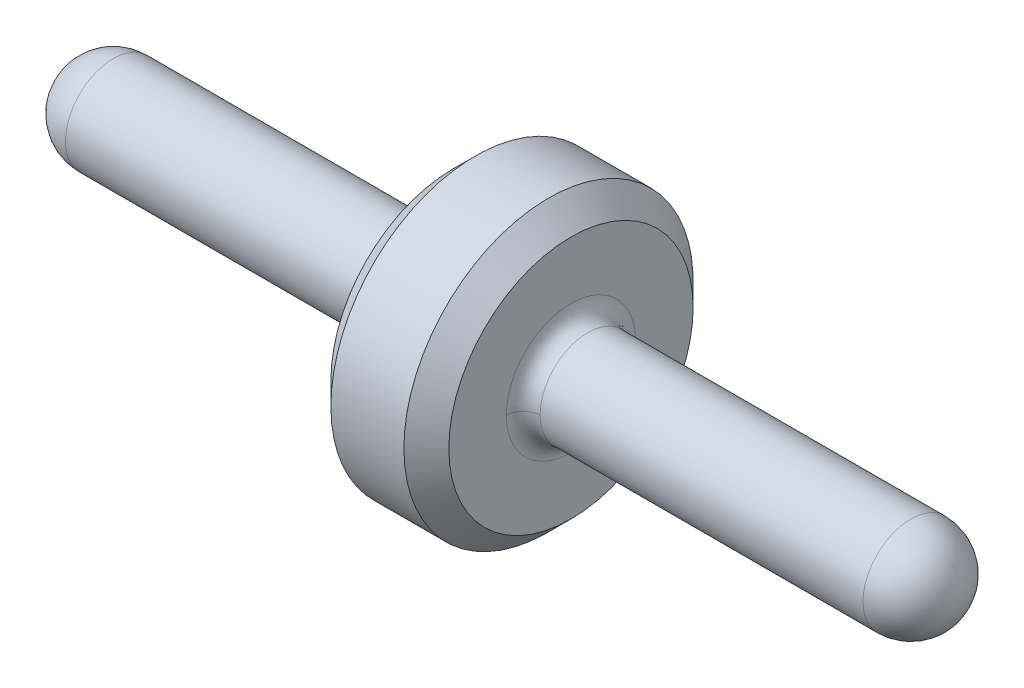
ISO-10303-21;
HEADER;
FILE_DESCRIPTION(('STEP AP214'),'2;1');
FILE_NAME('part.step','',(''),(''),'','','');
FILE_SCHEMA(('AUTOMOTIVE_DESIGN { 1 0 10303 214 1 1 1 1 }'));
ENDSEC;
DATA;
#1=APPLICATION_CONTEXT('core data for automotive mechanical design processes');
#2=APPLICATION_PROTOCOL_DEFINITION('international standard','automotive_design',2000,#1);
#3=PRODUCT_CONTEXT('',#1,'mechanical');
#4=PRODUCT('Part','Part','',(#3));
#5=PRODUCT_RELATED_PRODUCT_CATEGORY('part','',(#4));
#6=PRODUCT_DEFINITION_FORMATION('','',#4);
#7=PRODUCT_DEFINITION_CONTEXT('part definition',#1,'design');
#8=PRODUCT_DEFINITION('design','',#6,#7);
#9=PRODUCT_DEFINITION_SHAPE('','',#8);
#10=(LENGTH_UNIT() NAMED_UNIT(*) SI_UNIT(.MILLI.,.METRE.));
#11=(NAMED_UNIT(*) PLANE_ANGLE_UNIT() SI_UNIT($,.RADIAN.));
#12=(NAMED_UNIT(*) SI_UNIT($,.STERADIAN.) SOLID_ANGLE_UNIT());
#13=UNCERTAINTY_MEASURE_WITH_UNIT(LENGTH_MEASURE(1.E-05),#10,'distance_accuracy_value','');
#14=(GEOMETRIC_REPRESENTATION_CONTEXT(3) GLOBAL_UNCERTAINTY_ASSIGNED_CONTEXT((#13)) GLOBAL_UNIT_ASSIGNED_CONTEXT((#10,
#11,#12)) REPRESENTATION_CONTEXT('',''));
#15=CARTESIAN_POINT('',(0.,0.,0.));
#16=DIRECTION('',(0.,0.,1.));
#17=DIRECTION('',(1.,0.,0.));
#18=AXIS2_PLACEMENT_3D('',#15,#16,#17);
#19=CARTESIAN_POINT('',(3.8227,0.,0.));
#20=DIRECTION('',(-1.,0.,0.));
#21=DIRECTION('',(0.,-1.,0.));
#22=AXIS2_PLACEMENT_3D('',#19,#20,#21);
#23=SPHERICAL_SURFACE('',#22,0.2159);
#24=CARTESIAN_POINT('',(4.0386,2.159E-09,0.));
#25=VERTEX_POINT('',#24);
#26=VERTEX_LOOP('',#25);
#27=FACE_BOUND('',#26,.T.);
#28=CARTESIAN_POINT('',(3.8227,0.,0.));
#29=DIRECTION('',(-1.,0.,0.));
#30=DIRECTION('',(0.,0.,1.));
#31=AXIS2_PLACEMENT_3D('',#28,#29,#30);
#32=CIRCLE('',#31,0.2159);
#33=CARTESIAN_POINT('',(3.8227,0.,0.2159));
#34=VERTEX_POINT('',#33);
#35=EDGE_CURVE('E74',#34,#34,#32,.F.);
#36=ORIENTED_EDGE('',*,*,#35,.T.);
#37=EDGE_LOOP('',(#36));
#38=FACE_BOUND('',#37,.T.);
#39=ADVANCED_FACE('F17',(#27,#38),#23,.T.);
#40=CARTESIAN_POINT('',(3.8227,0.,0.));
#41=DIRECTION('',(-1.,0.,0.));
#42=DIRECTION('',(0.,0.,1.));
#43=AXIS2_PLACEMENT_3D('',#40,#41,#42);
#44=CYLINDRICAL_SURFACE('',#43,0.2159);
#45=CARTESIAN_POINT('',(2.3622,0.,0.));
#46=DIRECTION('',(-1.,0.,0.));
#47=DIRECTION('',(0.,0.,1.));
#48=AXIS2_PLACEMENT_3D('',#45,#46,#47);
#49=CIRCLE('',#48,0.2159);
#50=CARTESIAN_POINT('',(2.36219999777847,-4.428183021646E-11,-0.215900005892549));
#51=VERTEX_POINT('',#50);
#52=CARTESIAN_POINT('',(2.3622,-1.93864443777635E-11,0.2159));
#53=VERTEX_POINT('',#52);
#54=EDGE_CURVE('E22',#51,#53,#49,.F.);
#55=ORIENTED_EDGE('',*,*,#54,.T.);
#56=CARTESIAN_POINT('',(2.3622,0.,0.));
#57=DIRECTION('',(-1.,0.,0.));
#58=DIRECTION('',(0.,0.,1.));
#59=AXIS2_PLACEMENT_3D('',#56,#57,#58);
#60=CIRCLE('',#59,0.2159);
#61=EDGE_CURVE('E64',#51,#53,#60,.T.);
#62=ORIENTED_EDGE('',*,*,#61,.F.);
#63=EDGE_LOOP('',(#55,#62));
#64=FACE_BOUND('',#63,.T.);
#65=ORIENTED_EDGE('',*,*,#35,.F.);
#66=EDGE_LOOP('',(#65));
#67=FACE_BOUND('',#66,.T.);
#68=ADVANCED_FACE('F76',(#64,#67),#44,.T.);
#69=CARTESIAN_POINT('',(2.3698073,0.,-0.2162806952));
#70=CARTESIAN_POINT('',(2.3698073,-0.432561365,-0.2162806952));
#71=CARTESIAN_POINT('',(2.3698073,-0.432561365,0.2162806952));
#72=CARTESIAN_POINT('',(2.3698073,0.,0.2162806952));
#73=CARTESIAN_POINT('',(2.3179999106,0.,-0.2110826106));
#74=CARTESIAN_POINT('',(2.3179999106,-0.4221651958,-0.2110826106));
#75=CARTESIAN_POINT('',(2.3179999106,-0.4221651958,0.2110826106));
#76=CARTESIAN_POINT('',(2.3179999106,0.,0.2110826106));
#77=CARTESIAN_POINT('',(2.2811826106,0.,-0.2478999106));
#78=CARTESIAN_POINT('',(2.2811826106,-0.4957997958,-0.2478999106));
#79=CARTESIAN_POINT('',(2.2811826106,-0.4957997958,0.2478999106));
#80=CARTESIAN_POINT('',(2.2811826106,0.,0.2478999106));
#81=CARTESIAN_POINT('',(2.2863806952,0.,-0.2997073));
#82=CARTESIAN_POINT('',(2.2863806952,-0.5994146,-0.2997073));
#83=CARTESIAN_POINT('',(2.2863806952,-0.5994146,0.2997073));
#84=CARTESIAN_POINT('',(2.2863806952,0.,0.2997073));
#85=(BOUNDED_SURFACE() B_SPLINE_SURFACE(3,3,((#69,#70,#71,#72),(#73,#74,#75,#76),(#77,#78,#79,
#80),(#81,#82,#83,#84)),.UNSPECIFIED.,.F.,.F.,.F.) B_SPLINE_SURFACE_WITH_KNOTS((4,4),(4,4),(0.,
1.),(0.,1.),.UNSPECIFIED.) GEOMETRIC_REPRESENTATION_ITEM() RATIONAL_B_SPLINE_SURFACE(((1.,
0.333333333333333,0.333333333333333,1.),(0.755320871117973,0.251773623705991,0.251773623705991,
0.755320871117973),(0.755320871117973,0.251773623705991,0.251773623705991,0.755320871117973),
(1.,0.333333333333333,0.333333333333333,1.))) REPRESENTATION_ITEM('') SURFACE());
#86=CARTESIAN_POINT('',(2.3698073,0.,-0.2162806952));
#87=CARTESIAN_POINT('',(2.3179999106,0.,-0.2110826106));
#88=CARTESIAN_POINT('',(2.2811826106,0.,-0.2478999106));
#89=CARTESIAN_POINT('',(2.2863806952,0.,-0.2997073));
#90=(BOUNDED_CURVE() B_SPLINE_CURVE(3,(#86,#87,#88,#89),.UNSPECIFIED.,.F.,
.F.) B_SPLINE_CURVE_WITH_KNOTS((4,4),(0.,1.),
.UNSPECIFIED.) CURVE() GEOMETRIC_REPRESENTATION_ITEM() RATIONAL_B_SPLINE_CURVE((1.,
0.755320871117973,0.755320871117973,1.)) REPRESENTATION_ITEM(''));
#91=CARTESIAN_POINT('',(2.28600000707106,0.,-0.29209999924224));
#92=VERTEX_POINT('',#91);
#93=EDGE_CURVE('E72',#92,#51,#90,.F.);
#94=CARTESIAN_POINT('',(2.3698073,0.,0.2162806952));
#95=CARTESIAN_POINT('',(2.3179999106,0.,0.2110826106));
#96=CARTESIAN_POINT('',(2.2811826106,0.,0.2478999106));
#97=CARTESIAN_POINT('',(2.2863806952,0.,0.2997073));
#98=(BOUNDED_CURVE() B_SPLINE_CURVE(3,(#94,#95,#96,#97),.UNSPECIFIED.,.F.,
.F.) B_SPLINE_CURVE_WITH_KNOTS((4,4),(0.,1.),
.UNSPECIFIED.) CURVE() GEOMETRIC_REPRESENTATION_ITEM() RATIONAL_B_SPLINE_CURVE((1.,
0.755320871117973,0.755320871117973,1.)) REPRESENTATION_ITEM(''));
#99=CARTESIAN_POINT('',(2.28600000707106,0.,0.29209999924224));
#100=VERTEX_POINT('',#99);
#101=EDGE_CURVE('E69',#53,#100,#98,.T.);
#102=CARTESIAN_POINT('',(2.2860000117851,0.,0.29210000016356));
#103=CARTESIAN_POINT('',(2.2860000117851,-0.584199996761219,0.29210000016356));
#104=CARTESIAN_POINT('',(2.2860000117851,-0.584199996761219,-0.29210000016356));
#105=CARTESIAN_POINT('',(2.2860000117851,0.,-0.29210000016356));
#106=(BOUNDED_CURVE() B_SPLINE_CURVE(3,(#102,#103,#104,#105),.UNSPECIFIED.,.F.,
.F.) B_SPLINE_CURVE_WITH_KNOTS((4,4),(0.,1.),
.UNSPECIFIED.) CURVE() GEOMETRIC_REPRESENTATION_ITEM() RATIONAL_B_SPLINE_CURVE((0.956578326119741,
0.318859442039913,0.318859442039913,0.956578326119741)) REPRESENTATION_ITEM(''));
#107=EDGE_CURVE('E202',#100,#92,#106,.T.);
#108=ORIENTED_EDGE('',*,*,#93,.T.);
#109=ORIENTED_EDGE('',*,*,#61,.T.);
#110=ORIENTED_EDGE('',*,*,#101,.T.);
#111=ORIENTED_EDGE('',*,*,#107,.T.);
#112=EDGE_LOOP('',(#108,#109,#110,#111));
#113=FACE_BOUND('',#112,.T.);
#114=ADVANCED_FACE('F67',(#113),#85,.F.);
#115=CARTESIAN_POINT('',(2.3698073,0.,0.2162806952));
#116=CARTESIAN_POINT('',(2.3698073,0.432561365,0.2162806952));
#117=CARTESIAN_POINT('',(2.3698073,0.432561365,-0.2162806952));
#118=CARTESIAN_POINT('',(2.3698073,0.,-0.2162806952));
#119=CARTESIAN_POINT('',(2.3179999106,0.,0.2110826106));
#120=CARTESIAN_POINT('',(2.3179999106,0.4221651958,0.2110826106));
#121=CARTESIAN_POINT('',(2.3179999106,0.4221651958,-0.2110826106));
#122=CARTESIAN_POINT('',(2.3179999106,0.,-0.2110826106));
#123=CARTESIAN_POINT('',(2.2811826106,0.,0.2478999106));
#124=CARTESIAN_POINT('',(2.2811826106,0.4957997958,0.2478999106));
#125=CARTESIAN_POINT('',(2.2811826106,0.4957997958,-0.2478999106));
#126=CARTESIAN_POINT('',(2.2811826106,0.,-0.2478999106));
#127=CARTESIAN_POINT('',(2.2863806952,0.,0.2997073));
#128=CARTESIAN_POINT('',(2.2863806952,0.5994146,0.2997073));
#129=CARTESIAN_POINT('',(2.2863806952,0.5994146,-0.2997073));
#130=CARTESIAN_POINT('',(2.2863806952,0.,-0.2997073));
#131=(BOUNDED_SURFACE() B_SPLINE_SURFACE(3,3,((#115,#116,#117,#118),(#119,#120,#121,#122),(#123,
#124,#125,#126),(#127,#128,#129,#130)),.UNSPECIFIED.,.F.,.F.,
.F.) B_SPLINE_SURFACE_WITH_KNOTS((4,4),(4,4),(0.,1.),(0.,1.),
.UNSPECIFIED.) GEOMETRIC_REPRESENTATION_ITEM() RATIONAL_B_SPLINE_SURFACE(((1.,0.333333333333333,
0.333333333333333,1.),(0.755320871117973,0.251773623705991,0.251773623705991,0.755320871117973),
(0.755320871117973,0.251773623705991,0.251773623705991,0.755320871117973),(1.,0.333333333333333,
0.333333333333333,1.))) REPRESENTATION_ITEM('') SURFACE());
#132=CARTESIAN_POINT('',(2.2860000117851,0.,-0.292100000163559));
#133=CARTESIAN_POINT('',(2.2860000117851,0.584199996761219,-0.29210000016356));
#134=CARTESIAN_POINT('',(2.2860000117851,0.584199996761219,0.29210000016356));
#135=CARTESIAN_POINT('',(2.2860000117851,0.,0.292100000163559));
#136=(BOUNDED_CURVE() B_SPLINE_CURVE(3,(#132,#133,#134,#135),.UNSPECIFIED.,.F.,
.F.) B_SPLINE_CURVE_WITH_KNOTS((4,4),(0.,1.),
.UNSPECIFIED.) CURVE() GEOMETRIC_REPRESENTATION_ITEM() RATIONAL_B_SPLINE_CURVE((0.95657832611974,
0.318859442039913,0.318859442039913,0.95657832611974)) REPRESENTATION_ITEM(''));
#137=EDGE_CURVE('E81',#92,#100,#136,.T.);
#138=ORIENTED_EDGE('',*,*,#137,.T.);
#139=ORIENTED_EDGE('',*,*,#101,.F.);
#140=ORIENTED_EDGE('',*,*,#54,.F.);
#141=ORIENTED_EDGE('',*,*,#93,.F.);
#142=EDGE_LOOP('',(#138,#139,#140,#141));
#143=FACE_BOUND('',#142,.T.);
#144=ADVANCED_FACE('F79',(#143),#131,.F.);
#145=CARTESIAN_POINT('',(0.2159,0.,0.));
#146=DIRECTION('',(-1.,0.,0.));
#147=DIRECTION('',(0.,-1.,0.));
#148=AXIS2_PLACEMENT_3D('',#145,#146,#147);
#149=SPHERICAL_SURFACE('',#148,0.2159);
#150=CARTESIAN_POINT('',(0.,2.07043632644582E-09,0.));
#151=VERTEX_POINT('',#150);
#152=VERTEX_LOOP('',#151);
#153=FACE_BOUND('',#152,.T.);
#154=CARTESIAN_POINT('',(0.2159,0.,0.));
#155=DIRECTION('',(-1.,0.,0.));
#156=DIRECTION('',(0.,0.,1.));
#157=AXIS2_PLACEMENT_3D('',#154,#155,#156);
#158=CIRCLE('',#157,0.2159);
#159=CARTESIAN_POINT('',(0.2159,0.,0.2159));
#160=VERTEX_POINT('',#159);
#161=EDGE_CURVE('E194',#160,#160,#158,.T.);
#162=ORIENTED_EDGE('',*,*,#161,.T.);
#163=EDGE_LOOP('',(#162));
#164=FACE_BOUND('',#163,.T.);
#165=ADVANCED_FACE('F115',(#153,#164),#149,.T.);
#166=CARTESIAN_POINT('',(2.286,-0.5590794,-0.5590794));
#167=DIRECTION('',(-1.,0.,0.));
#168=DIRECTION('',(0.,0.,1.));
#169=AXIS2_PLACEMENT_3D('',#166,#167,#168);
#170=PLANE('',#169);
#171=ORIENTED_EDGE('',*,*,#107,.F.);
#172=ORIENTED_EDGE('',*,*,#137,.F.);
#173=EDGE_LOOP('',(#171,#172));
#174=FACE_BOUND('',#173,.T.);
#175=CARTESIAN_POINT('',(2.28600000000001,0.,0.));
#176=DIRECTION('',(-1.,0.,0.));
#177=DIRECTION('',(0.,0.,1.));
#178=AXIS2_PLACEMENT_3D('',#175,#176,#177);
#179=CIRCLE('',#178,0.552449999999991);
#180=CARTESIAN_POINT('',(2.28600000000001,0.,0.552449999999991));
#181=VERTEX_POINT('',#180);
#182=EDGE_CURVE('E192',#181,#181,#179,.F.);
#183=ORIENTED_EDGE('',*,*,#182,.T.);
#184=EDGE_LOOP('',(#183));
#185=FACE_BOUND('',#184,.T.);
#186=ADVANCED_FACE('F146',(#174,#185),#170,.F.);
#187=CARTESIAN_POINT('',(1.6764,0.,0.));
#188=DIRECTION('',(-1.,0.,0.));
#189=DIRECTION('',(0.,-1.,0.));
#190=AXIS2_PLACEMENT_3D('',#187,#188,#189);
#191=CYLINDRICAL_SURFACE('',#190,0.2159);
#192=ORIENTED_EDGE('',*,*,#161,.F.);
#193=EDGE_LOOP('',(#192));
#194=FACE_BOUND('',#193,.T.);
#195=CARTESIAN_POINT('',(1.6764,0.,0.));
#196=DIRECTION('',(-1.,0.,0.));
#197=DIRECTION('',(0.,-1.,0.));
#198=AXIS2_PLACEMENT_3D('',#195,#196,#197);
#199=CIRCLE('',#198,0.2159);
#200=CARTESIAN_POINT('',(1.67640000222154,-1.93864443777635E-11,0.215900005892549));
#201=VERTEX_POINT('',#200);
#202=CARTESIAN_POINT('',(1.6764,-4.428183021646E-11,-0.2159));
#203=VERTEX_POINT('',#202);
#204=EDGE_CURVE('E188',#201,#203,#199,.T.);
#205=ORIENTED_EDGE('',*,*,#204,.T.);
#206=CARTESIAN_POINT('',(1.6764,0.,0.));
#207=DIRECTION('',(-1.,0.,0.));
#208=DIRECTION('',(0.,0.,1.));
#209=AXIS2_PLACEMENT_3D('',#206,#207,#208);
#210=CIRCLE('',#209,0.2159);
#211=EDGE_CURVE('E85',#201,#203,#210,.F.);
#212=ORIENTED_EDGE('',*,*,#211,.F.);
#213=EDGE_LOOP('',(#205,#212));
#214=FACE_BOUND('',#213,.T.);
#215=ADVANCED_FACE('F149',(#194,#214),#191,.T.);
#216=CARTESIAN_POINT('',(2.286,0.,0.));
#217=DIRECTION('',(-1.,0.,0.));
#218=DIRECTION('',(0.,0.,1.));
#219=AXIS2_PLACEMENT_3D('',#216,#217,#218);
#220=CONICAL_SURFACE('',#219,0.55245,0.785398163397449);
#221=ORIENTED_EDGE('',*,*,#182,.F.);
#222=EDGE_LOOP('',(#221));
#223=FACE_BOUND('',#222,.T.);
#224=CARTESIAN_POINT('',(2.1844,0.,0.));
#225=DIRECTION('',(-1.,0.,0.));
#226=DIRECTION('',(0.,0.,1.));
#227=AXIS2_PLACEMENT_3D('',#224,#225,#226);
#228=CIRCLE('',#227,0.65405);
#229=CARTESIAN_POINT('',(2.1844,0.,0.65405));
#230=VERTEX_POINT('',#229);
#231=EDGE_CURVE('E207',#230,#230,#228,.F.);
#232=ORIENTED_EDGE('',*,*,#231,.T.);
#233=EDGE_LOOP('',(#232));
#234=FACE_BOUND('',#233,.T.);
#235=ADVANCED_FACE('F256',(#223,#234),#220,.T.);
#236=CARTESIAN_POINT('',(1.7522193048,0.,-0.2997073));
#237=CARTESIAN_POINT('',(1.7522193048,-0.5994146,-0.2997073));
#238=CARTESIAN_POINT('',(1.7522193048,-0.5994146,0.2997073));
#239=CARTESIAN_POINT('',(1.7522193048,0.,0.2997073));
#240=CARTESIAN_POINT('',(1.7574173894,0.,-0.2478999106));
#241=CARTESIAN_POINT('',(1.7574173894,-0.4957997958,-0.2478999106));
#242=CARTESIAN_POINT('',(1.7574173894,-0.4957997958,0.2478999106));
#243=CARTESIAN_POINT('',(1.7574173894,0.,0.2478999106));
#244=CARTESIAN_POINT('',(1.7206000894,0.,-0.2110826106));
#245=CARTESIAN_POINT('',(1.7206000894,-0.4221651958,-0.2110826106));
#246=CARTESIAN_POINT('',(1.7206000894,-0.4221651958,0.2110826106));
#247=CARTESIAN_POINT('',(1.7206000894,0.,0.2110826106));
#248=CARTESIAN_POINT('',(1.6687927,0.,-0.2162806952));
#249=CARTESIAN_POINT('',(1.6687927,-0.432561365,-0.2162806952));
#250=CARTESIAN_POINT('',(1.6687927,-0.432561365,0.2162806952));
#251=CARTESIAN_POINT('',(1.6687927,0.,0.2162806952));
#252=(BOUNDED_SURFACE() B_SPLINE_SURFACE(3,3,((#236,#237,#238,#239),(#240,#241,#242,#243),(#244,
#245,#246,#247),(#248,#249,#250,#251)),.UNSPECIFIED.,.F.,.F.,
.F.) B_SPLINE_SURFACE_WITH_KNOTS((4,4),(4,4),(0.,1.),(0.,1.),
.UNSPECIFIED.) GEOMETRIC_REPRESENTATION_ITEM() RATIONAL_B_SPLINE_SURFACE(((1.,0.333333333333333,
0.333333333333333,1.),(0.755320871117972,0.251773623705991,0.251773623705991,0.755320871117972),
(0.755320871117972,0.251773623705991,0.251773623705991,0.755320871117972),(1.,0.333333333333333,
0.333333333333333,1.))) REPRESENTATION_ITEM('') SURFACE());
#253=CARTESIAN_POINT('',(1.7522193048,0.,-0.2997073));
#254=CARTESIAN_POINT('',(1.7574173894,0.,-0.2478999106));
#255=CARTESIAN_POINT('',(1.7206000894,0.,-0.2110826106));
#256=CARTESIAN_POINT('',(1.6687927,0.,-0.2162806952));
#257=(BOUNDED_CURVE() B_SPLINE_CURVE(3,(#253,#254,#255,#256),.UNSPECIFIED.,.F.,
.F.) B_SPLINE_CURVE_WITH_KNOTS((4,4),(0.,1.),
.UNSPECIFIED.) CURVE() GEOMETRIC_REPRESENTATION_ITEM() RATIONAL_B_SPLINE_CURVE((1.,
0.755320871117972,0.755320871117972,1.)) REPRESENTATION_ITEM(''));
#258=CARTESIAN_POINT('',(1.75259999292894,0.,-0.29209999924224));
#259=VERTEX_POINT('',#258);
#260=EDGE_CURVE('E190',#203,#259,#257,.F.);
#261=CARTESIAN_POINT('',(1.7525999882149,0.,-0.29210000016356));
#262=CARTESIAN_POINT('',(1.7525999882149,-0.584199996761219,-0.29210000016356));
#263=CARTESIAN_POINT('',(1.7525999882149,-0.584199996761219,0.29210000016356));
#264=CARTESIAN_POINT('',(1.7525999882149,0.,0.29210000016356));
#265=(BOUNDED_CURVE() B_SPLINE_CURVE(3,(#261,#262,#263,#264),.UNSPECIFIED.,.F.,
.F.) B_SPLINE_CURVE_WITH_KNOTS((4,4),(0.,1.),
.UNSPECIFIED.) CURVE() GEOMETRIC_REPRESENTATION_ITEM() RATIONAL_B_SPLINE_CURVE((0.956578326119741,
0.318859442039913,0.318859442039913,0.956578326119741)) REPRESENTATION_ITEM(''));
#266=CARTESIAN_POINT('',(1.75259999292894,0.,0.29209999924224));
#267=VERTEX_POINT('',#266);
#268=EDGE_CURVE('E37',#259,#267,#265,.T.);
#269=CARTESIAN_POINT('',(1.7522193048,0.,0.2997073));
#270=CARTESIAN_POINT('',(1.7574173894,0.,0.2478999106));
#271=CARTESIAN_POINT('',(1.7206000894,0.,0.2110826106));
#272=CARTESIAN_POINT('',(1.6687927,0.,0.2162806952));
#273=(BOUNDED_CURVE() B_SPLINE_CURVE(3,(#269,#270,#271,#272),.UNSPECIFIED.,.F.,
.F.) B_SPLINE_CURVE_WITH_KNOTS((4,4),(0.,1.),
.UNSPECIFIED.) CURVE() GEOMETRIC_REPRESENTATION_ITEM() RATIONAL_B_SPLINE_CURVE((1.,
0.755320871117972,0.755320871117972,1.)) REPRESENTATION_ITEM(''));
#274=EDGE_CURVE('E191',#267,#201,#273,.T.);
#275=ORIENTED_EDGE('',*,*,#260,.T.);
#276=ORIENTED_EDGE('',*,*,#268,.T.);
#277=ORIENTED_EDGE('',*,*,#274,.T.);
#278=ORIENTED_EDGE('',*,*,#211,.T.);
#279=EDGE_LOOP('',(#275,#276,#277,#278));
#280=FACE_BOUND('',#279,.T.);
#281=ADVANCED_FACE('F244',(#280),#252,.F.);
#282=CARTESIAN_POINT('',(1.7522193048,0.,0.2997073));
#283=CARTESIAN_POINT('',(1.7522193048,0.5994146,0.2997073));
#284=CARTESIAN_POINT('',(1.7522193048,0.5994146,-0.2997073));
#285=CARTESIAN_POINT('',(1.7522193048,0.,-0.2997073));
#286=CARTESIAN_POINT('',(1.7574173894,0.,0.2478999106));
#287=CARTESIAN_POINT('',(1.7574173894,0.4957997958,0.2478999106));
#288=CARTESIAN_POINT('',(1.7574173894,0.4957997958,-0.2478999106));
#289=CARTESIAN_POINT('',(1.7574173894,0.,-0.2478999106));
#290=CARTESIAN_POINT('',(1.7206000894,0.,0.2110826106));
#291=CARTESIAN_POINT('',(1.7206000894,0.4221651958,0.2110826106));
#292=CARTESIAN_POINT('',(1.7206000894,0.4221651958,-0.2110826106));
#293=CARTESIAN_POINT('',(1.7206000894,0.,-0.2110826106));
#294=CARTESIAN_POINT('',(1.6687927,0.,0.2162806952));
#295=CARTESIAN_POINT('',(1.6687927,0.432561365,0.2162806952));
#296=CARTESIAN_POINT('',(1.6687927,0.432561365,-0.2162806952));
#297=CARTESIAN_POINT('',(1.6687927,0.,-0.2162806952));
#298=(BOUNDED_SURFACE() B_SPLINE_SURFACE(3,3,((#282,#283,#284,#285),(#286,#287,#288,#289),(#290,
#291,#292,#293),(#294,#295,#296,#297)),.UNSPECIFIED.,.F.,.F.,
.F.) B_SPLINE_SURFACE_WITH_KNOTS((4,4),(4,4),(0.,1.),(0.,1.),
.UNSPECIFIED.) GEOMETRIC_REPRESENTATION_ITEM() RATIONAL_B_SPLINE_SURFACE(((1.,0.333333333333333,
0.333333333333333,1.),(0.755320871117972,0.251773623705991,0.251773623705991,0.755320871117972),
(0.755320871117972,0.251773623705991,0.251773623705991,0.755320871117972),(1.,0.333333333333333,
0.333333333333333,1.))) REPRESENTATION_ITEM('') SURFACE());
#299=CARTESIAN_POINT('',(1.7525999882149,0.,0.292100000163559));
#300=CARTESIAN_POINT('',(1.7525999882149,0.584199996761219,0.292100000163559));
#301=CARTESIAN_POINT('',(1.7525999882149,0.584199996761219,-0.292100000163559));
#302=CARTESIAN_POINT('',(1.7525999882149,0.,-0.292100000163559));
#303=(BOUNDED_CURVE() B_SPLINE_CURVE(3,(#299,#300,#301,#302),.UNSPECIFIED.,.F.,
.F.) B_SPLINE_CURVE_WITH_KNOTS((4,4),(0.,1.),
.UNSPECIFIED.) CURVE() GEOMETRIC_REPRESENTATION_ITEM() RATIONAL_B_SPLINE_CURVE((0.95657832611974,
0.318859442039913,0.318859442039913,0.95657832611974)) REPRESENTATION_ITEM(''));
#304=EDGE_CURVE('E179',#267,#259,#303,.T.);
#305=ORIENTED_EDGE('',*,*,#204,.F.);
#306=ORIENTED_EDGE('',*,*,#274,.F.);
#307=ORIENTED_EDGE('',*,*,#304,.T.);
#308=ORIENTED_EDGE('',*,*,#260,.F.);
#309=EDGE_LOOP('',(#305,#306,#307,#308));
#310=FACE_BOUND('',#309,.T.);
#311=ADVANCED_FACE('F231',(#310),#298,.F.);
#312=CARTESIAN_POINT('',(2.1844,0.,0.));
#313=DIRECTION('',(-1.,0.,0.));
#314=DIRECTION('',(0.,-1.,0.));
#315=AXIS2_PLACEMENT_3D('',#312,#313,#314);
#316=CYLINDRICAL_SURFACE('',#315,0.65405);
#317=ORIENTED_EDGE('',*,*,#231,.F.);
#318=EDGE_LOOP('',(#317));
#319=FACE_BOUND('',#318,.T.);
#320=CARTESIAN_POINT('',(1.85420000000003,0.,0.));
#321=DIRECTION('',(1.,0.,0.));
#322=DIRECTION('',(0.,0.,-1.));
#323=AXIS2_PLACEMENT_3D('',#320,#321,#322);
#324=CIRCLE('',#323,0.65405);
#325=CARTESIAN_POINT('',(1.8542,0.,-0.65405));
#326=VERTEX_POINT('',#325);
#327=EDGE_CURVE('E28',#326,#326,#324,.T.);
#328=ORIENTED_EDGE('',*,*,#327,.T.);
#329=EDGE_LOOP('',(#328));
#330=FACE_BOUND('',#329,.T.);
#331=ADVANCED_FACE('F243',(#319,#330),#316,.T.);
#332=CARTESIAN_POINT('',(1.7526,-0.5590794,0.5590794));
#333=DIRECTION('',(1.,0.,0.));
#334=DIRECTION('',(0.,0.,-1.));
#335=AXIS2_PLACEMENT_3D('',#332,#333,#334);
#336=PLANE('',#335);
#337=ORIENTED_EDGE('',*,*,#268,.F.);
#338=ORIENTED_EDGE('',*,*,#304,.F.);
#339=EDGE_LOOP('',(#337,#338));
#340=FACE_BOUND('',#339,.T.);
#341=CARTESIAN_POINT('',(1.75259999999999,0.,0.));
#342=DIRECTION('',(1.,0.,0.));
#343=DIRECTION('',(0.,0.,-1.));
#344=AXIS2_PLACEMENT_3D('',#341,#342,#343);
#345=CIRCLE('',#344,0.552449999999993);
#346=CARTESIAN_POINT('',(1.75259999999999,0.,-0.552449999999993));
#347=VERTEX_POINT('',#346);
#348=EDGE_CURVE('E11',#347,#347,#345,.F.);
#349=ORIENTED_EDGE('',*,*,#348,.T.);
#350=EDGE_LOOP('',(#349));
#351=FACE_BOUND('',#350,.T.);
#352=ADVANCED_FACE('F19',(#340,#351),#336,.F.);
#353=CARTESIAN_POINT('',(1.7526,0.,0.));
#354=DIRECTION('',(1.,0.,0.));
#355=DIRECTION('',(0.,0.,-1.));
#356=AXIS2_PLACEMENT_3D('',#353,#354,#355);
#357=CONICAL_SURFACE('',#356,0.55245,0.785398163397449);
#358=ORIENTED_EDGE('',*,*,#348,.F.);
#359=EDGE_LOOP('',(#358));
#360=FACE_BOUND('',#359,.T.);
#361=ORIENTED_EDGE('',*,*,#327,.F.);
#362=EDGE_LOOP('',(#361));
#363=FACE_BOUND('',#362,.T.);
#364=ADVANCED_FACE('F273',(#360,#363),#357,.T.);
#365=CLOSED_SHELL('',(#39,#68,#114,#144,#165,#186,#215,#235,#281,#311,#331,#352,#364));
#366=MANIFOLD_SOLID_BREP('B1',#365);
#367=ADVANCED_BREP_SHAPE_REPRESENTATION('',(#18,#366),#14);
#368=SHAPE_DEFINITION_REPRESENTATION(#9,#367);
ENDSEC;
END-ISO-10303-21;
